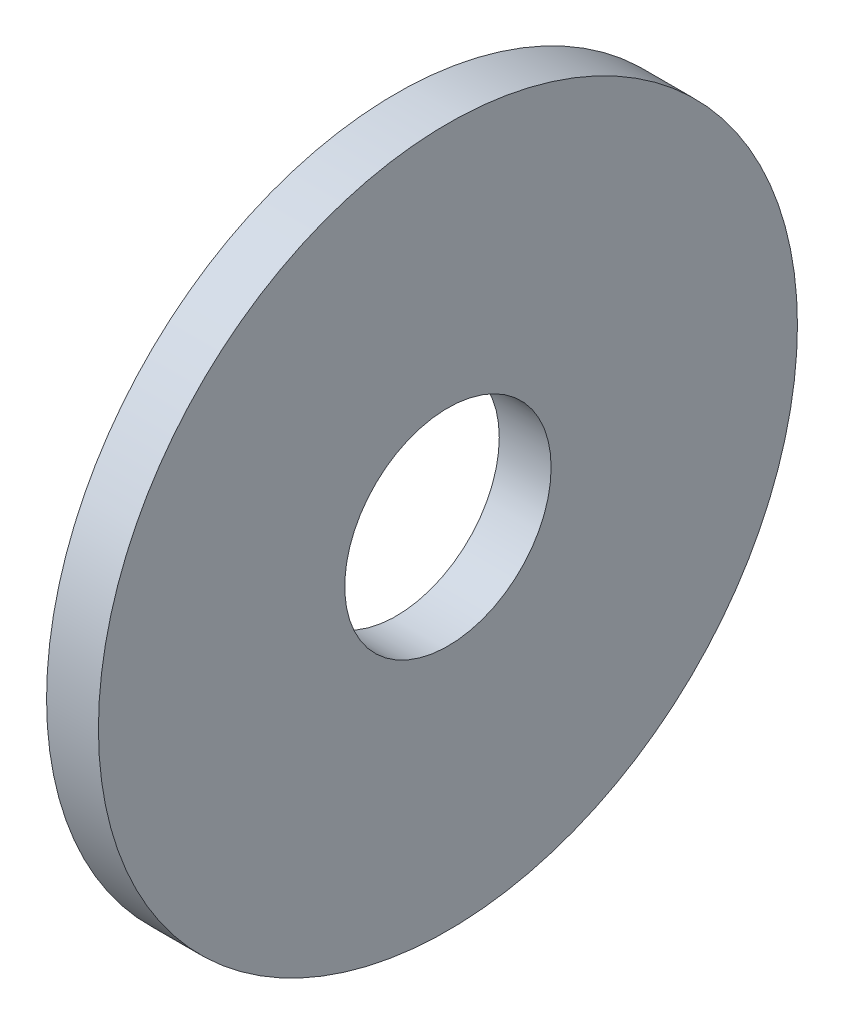
ISO-10303-21;
HEADER;
FILE_DESCRIPTION(('STEP AP214'),'2;1');
FILE_NAME('part.step','',(''),(''),'','','');
FILE_SCHEMA(('AUTOMOTIVE_DESIGN { 1 0 10303 214 1 1 1 1 }'));
ENDSEC;
DATA;
#1=APPLICATION_CONTEXT('core data for automotive mechanical design processes');
#2=APPLICATION_PROTOCOL_DEFINITION('international standard','automotive_design',2000,#1);
#3=PRODUCT_CONTEXT('',#1,'mechanical');
#4=PRODUCT('Part','Part','',(#3));
#5=PRODUCT_RELATED_PRODUCT_CATEGORY('part','',(#4));
#6=PRODUCT_DEFINITION_FORMATION('','',#4);
#7=PRODUCT_DEFINITION_CONTEXT('part definition',#1,'design');
#8=PRODUCT_DEFINITION('design','',#6,#7);
#9=PRODUCT_DEFINITION_SHAPE('','',#8);
#10=(LENGTH_UNIT() NAMED_UNIT(*) SI_UNIT(.MILLI.,.METRE.));
#11=(NAMED_UNIT(*) PLANE_ANGLE_UNIT() SI_UNIT($,.RADIAN.));
#12=(NAMED_UNIT(*) SI_UNIT($,.STERADIAN.) SOLID_ANGLE_UNIT());
#13=UNCERTAINTY_MEASURE_WITH_UNIT(LENGTH_MEASURE(1.E-05),#10,'distance_accuracy_value','');
#14=(GEOMETRIC_REPRESENTATION_CONTEXT(3) GLOBAL_UNCERTAINTY_ASSIGNED_CONTEXT((#13)) GLOBAL_UNIT_ASSIGNED_CONTEXT((#10,
#11,#12)) REPRESENTATION_CONTEXT('',''));
#15=CARTESIAN_POINT('',(0.,0.,0.));
#16=DIRECTION('',(0.,0.,1.));
#17=DIRECTION('',(1.,0.,0.));
#18=AXIS2_PLACEMENT_3D('',#15,#16,#17);
#19=CARTESIAN_POINT('',(1.2954,0.,0.));
#20=DIRECTION('',(1.,0.,0.));
#21=DIRECTION('',(0.,0.,-1.));
#22=AXIS2_PLACEMENT_3D('',#19,#20,#21);
#23=PLANE('',#22);
#24=CARTESIAN_POINT('',(1.2954,0.,0.));
#25=DIRECTION('',(1.,0.,0.));
#26=DIRECTION('',(0.,0.,-1.));
#27=AXIS2_PLACEMENT_3D('',#24,#25,#26);
#28=CIRCLE('',#27,8.73125);
#29=CARTESIAN_POINT('',(1.2954,0.,-8.73125));
#30=VERTEX_POINT('',#29);
#31=EDGE_CURVE('E10',#30,#30,#28,.T.);
#32=ORIENTED_EDGE('',*,*,#31,.T.);
#33=EDGE_LOOP('',(#32));
#34=FACE_BOUND('',#33,.T.);
#35=CARTESIAN_POINT('',(1.2954,0.,0.));
#36=DIRECTION('',(1.,0.,0.));
#37=DIRECTION('',(0.,0.,-1.));
#38=AXIS2_PLACEMENT_3D('',#35,#36,#37);
#39=CIRCLE('',#38,2.5781);
#40=CARTESIAN_POINT('',(1.2954,0.,-2.5781));
#41=VERTEX_POINT('',#40);
#42=EDGE_CURVE('E43',#41,#41,#39,.T.);
#43=ORIENTED_EDGE('',*,*,#42,.F.);
#44=EDGE_LOOP('',(#43));
#45=FACE_BOUND('',#44,.T.);
#46=ADVANCED_FACE('F32',(#34,#45),#23,.T.);
#47=CARTESIAN_POINT('',(0.,0.,0.));
#48=DIRECTION('',(1.,0.,0.));
#49=DIRECTION('',(0.,0.,-1.));
#50=AXIS2_PLACEMENT_3D('',#47,#48,#49);
#51=PLANE('',#50);
#52=CARTESIAN_POINT('',(0.,0.,0.));
#53=DIRECTION('',(1.,0.,0.));
#54=DIRECTION('',(0.,0.,-1.));
#55=AXIS2_PLACEMENT_3D('',#52,#53,#54);
#56=CIRCLE('',#55,8.73125);
#57=CARTESIAN_POINT('',(0.,0.,-8.73125));
#58=VERTEX_POINT('',#57);
#59=EDGE_CURVE('E36',#58,#58,#56,.T.);
#60=ORIENTED_EDGE('',*,*,#59,.F.);
#61=EDGE_LOOP('',(#60));
#62=FACE_BOUND('',#61,.T.);
#63=CARTESIAN_POINT('',(0.,0.,0.));
#64=DIRECTION('',(1.,0.,0.));
#65=DIRECTION('',(0.,0.,-1.));
#66=AXIS2_PLACEMENT_3D('',#63,#64,#65);
#67=CIRCLE('',#66,2.5781);
#68=CARTESIAN_POINT('',(0.,0.,-2.5781));
#69=VERTEX_POINT('',#68);
#70=EDGE_CURVE('E45',#69,#69,#67,.T.);
#71=ORIENTED_EDGE('',*,*,#70,.T.);
#72=EDGE_LOOP('',(#71));
#73=FACE_BOUND('',#72,.T.);
#74=ADVANCED_FACE('F55',(#62,#73),#51,.F.);
#75=CARTESIAN_POINT('',(1.2954,0.,0.));
#76=DIRECTION('',(-1.,0.,0.));
#77=DIRECTION('',(0.,0.,1.));
#78=AXIS2_PLACEMENT_3D('',#75,#76,#77);
#79=CYLINDRICAL_SURFACE('',#78,8.73125);
#80=ORIENTED_EDGE('',*,*,#31,.F.);
#81=EDGE_LOOP('',(#80));
#82=FACE_BOUND('',#81,.T.);
#83=ORIENTED_EDGE('',*,*,#59,.T.);
#84=EDGE_LOOP('',(#83));
#85=FACE_BOUND('',#84,.T.);
#86=ADVANCED_FACE('F34',(#82,#85),#79,.T.);
#87=CARTESIAN_POINT('',(1.2954,0.,0.));
#88=DIRECTION('',(-1.,0.,0.));
#89=DIRECTION('',(0.,0.,1.));
#90=AXIS2_PLACEMENT_3D('',#87,#88,#89);
#91=CYLINDRICAL_SURFACE('',#90,2.5781);
#92=ORIENTED_EDGE('',*,*,#42,.T.);
#93=EDGE_LOOP('',(#92));
#94=FACE_BOUND('',#93,.T.);
#95=ORIENTED_EDGE('',*,*,#70,.F.);
#96=EDGE_LOOP('',(#95));
#97=FACE_BOUND('',#96,.T.);
#98=ADVANCED_FACE('F51',(#94,#97),#91,.F.);
#99=CLOSED_SHELL('',(#46,#74,#86,#98));
#100=MANIFOLD_SOLID_BREP('B2',#99);
#101=ADVANCED_BREP_SHAPE_REPRESENTATION('',(#18,#100),#14);
#102=SHAPE_DEFINITION_REPRESENTATION(#9,#101);
ENDSEC;
END-ISO-10303-21;
